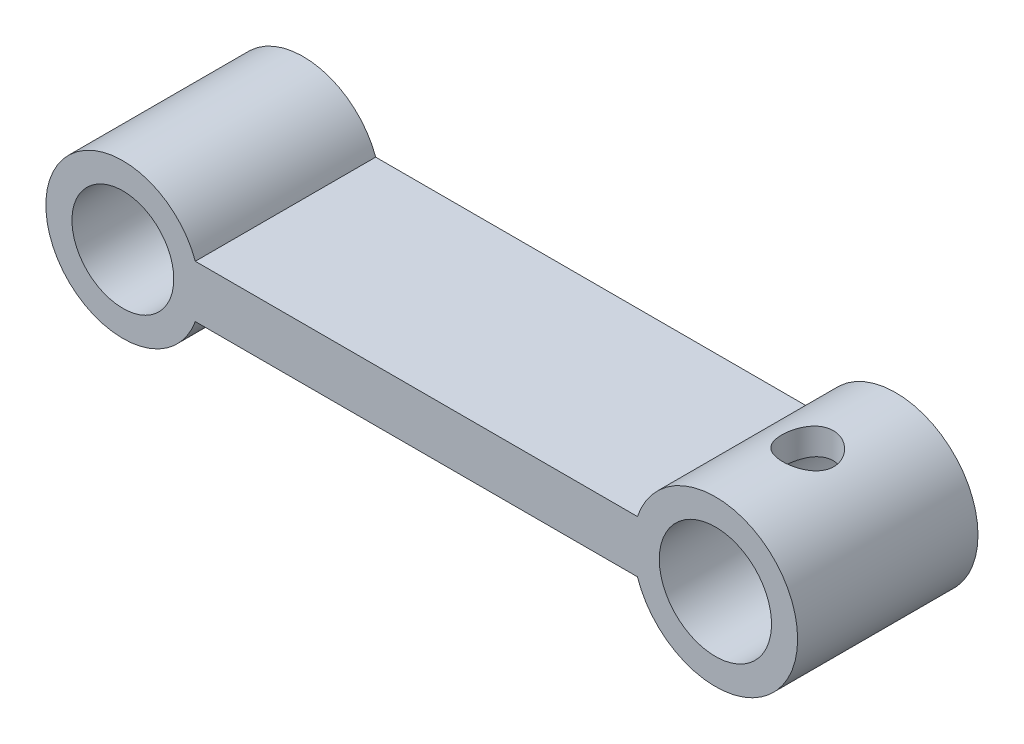
ISO-10303-21;
HEADER;
FILE_DESCRIPTION(('STEP AP214'),'2;1');
FILE_NAME('part.step','',(''),(''),'','','');
FILE_SCHEMA(('AUTOMOTIVE_DESIGN { 1 0 10303 214 1 1 1 1 }'));
ENDSEC;
DATA;
#1=APPLICATION_CONTEXT('core data for automotive mechanical design processes');
#2=APPLICATION_PROTOCOL_DEFINITION('international standard','automotive_design',2000,#1);
#3=PRODUCT_CONTEXT('',#1,'mechanical');
#4=PRODUCT('Part','Part','',(#3));
#5=PRODUCT_RELATED_PRODUCT_CATEGORY('part','',(#4));
#6=PRODUCT_DEFINITION_FORMATION('','',#4);
#7=PRODUCT_DEFINITION_CONTEXT('part definition',#1,'design');
#8=PRODUCT_DEFINITION('design','',#6,#7);
#9=PRODUCT_DEFINITION_SHAPE('','',#8);
#10=(LENGTH_UNIT() NAMED_UNIT(*) SI_UNIT(.MILLI.,.METRE.));
#11=(NAMED_UNIT(*) PLANE_ANGLE_UNIT() SI_UNIT($,.RADIAN.));
#12=(NAMED_UNIT(*) SI_UNIT($,.STERADIAN.) SOLID_ANGLE_UNIT());
#13=UNCERTAINTY_MEASURE_WITH_UNIT(LENGTH_MEASURE(1.E-05),#10,'distance_accuracy_value','');
#14=(GEOMETRIC_REPRESENTATION_CONTEXT(3) GLOBAL_UNCERTAINTY_ASSIGNED_CONTEXT((#13)) GLOBAL_UNIT_ASSIGNED_CONTEXT((#10,
#11,#12)) REPRESENTATION_CONTEXT('',''));
#15=CARTESIAN_POINT('',(0.,0.,0.));
#16=DIRECTION('',(0.,0.,1.));
#17=DIRECTION('',(1.,0.,0.));
#18=AXIS2_PLACEMENT_3D('',#15,#16,#17);
#19=CARTESIAN_POINT('',(-11.2441412055134,0.,6.91));
#20=DIRECTION('',(0.,0.,1.));
#21=DIRECTION('',(1.,0.,0.));
#22=AXIS2_PLACEMENT_3D('',#19,#20,#21);
#23=PLANE('',#22);
#24=CARTESIAN_POINT('',(-11.2441412055134,0.,6.91));
#25=DIRECTION('',(0.,0.,1.));
#26=DIRECTION('',(1.,0.,0.));
#27=AXIS2_PLACEMENT_3D('',#24,#25,#26);
#28=CIRCLE('',#27,1.95);
#29=CARTESIAN_POINT('',(-9.29414120551341,0.,6.91));
#30=VERTEX_POINT('',#29);
#31=EDGE_CURVE('E109',#30,#30,#28,.T.);
#32=ORIENTED_EDGE('',*,*,#31,.F.);
#33=EDGE_LOOP('',(#32));
#34=FACE_BOUND('',#33,.T.);
#35=CARTESIAN_POINT('',(-11.2441412055134,0.,6.91));
#36=DIRECTION('',(0.,0.,1.));
#37=DIRECTION('',(1.,0.,0.));
#38=AXIS2_PLACEMENT_3D('',#35,#36,#37);
#39=CIRCLE('',#38,2.95);
#40=CARTESIAN_POINT('',(-8.46880338823782,0.999999999999997,6.91));
#41=VERTEX_POINT('',#40);
#42=CARTESIAN_POINT('',(-8.46880338823782,-1.,6.91));
#43=VERTEX_POINT('',#42);
#44=EDGE_CURVE('E93',#41,#43,#39,.T.);
#45=ORIENTED_EDGE('',*,*,#44,.T.);
#46=DIRECTION('',(1.,0.,0.));
#47=VECTOR('',#46,1.);
#48=CARTESIAN_POINT('',(8.46880338823782,-1.,6.91));
#49=LINE('',#48,#47);
#50=CARTESIAN_POINT('',(8.46880338823782,-1.,6.91));
#51=VERTEX_POINT('',#50);
#52=EDGE_CURVE('E88',#43,#51,#49,.T.);
#53=ORIENTED_EDGE('',*,*,#52,.T.);
#54=CARTESIAN_POINT('',(11.4558587944866,0.,6.91));
#55=DIRECTION('',(0.,0.,1.));
#56=DIRECTION('',(1.,0.,0.));
#57=AXIS2_PLACEMENT_3D('',#54,#55,#56);
#58=CIRCLE('',#57,3.15);
#59=CARTESIAN_POINT('',(8.46880338823782,1.,6.91));
#60=VERTEX_POINT('',#59);
#61=EDGE_CURVE('E91',#51,#60,#58,.T.);
#62=ORIENTED_EDGE('',*,*,#61,.T.);
#63=DIRECTION('',(-1.,0.,0.));
#64=VECTOR('',#63,1.);
#65=CARTESIAN_POINT('',(8.46880338823782,1.,6.91));
#66=LINE('',#65,#64);
#67=EDGE_CURVE('E58',#60,#41,#66,.T.);
#68=ORIENTED_EDGE('',*,*,#67,.T.);
#69=EDGE_LOOP('',(#45,#53,#62,#68));
#70=FACE_BOUND('',#69,.T.);
#71=CARTESIAN_POINT('',(11.4558587944866,0.,6.91));
#72=DIRECTION('',(0.,0.,1.));
#73=DIRECTION('',(-1.,0.,0.));
#74=AXIS2_PLACEMENT_3D('',#71,#72,#73);
#75=CIRCLE('',#74,2.15);
#76=CARTESIAN_POINT('',(9.30585879448659,0.,6.91));
#77=VERTEX_POINT('',#76);
#78=EDGE_CURVE('E175',#77,#77,#75,.T.);
#79=ORIENTED_EDGE('',*,*,#78,.F.);
#80=EDGE_LOOP('',(#79));
#81=FACE_BOUND('',#80,.T.);
#82=ADVANCED_FACE('F35',(#34,#70,#81),#23,.T.);
#83=CARTESIAN_POINT('',(-11.2441412055134,0.,0.));
#84=DIRECTION('',(0.,0.,1.));
#85=DIRECTION('',(1.,0.,0.));
#86=AXIS2_PLACEMENT_3D('',#83,#84,#85);
#87=PLANE('',#86);
#88=CARTESIAN_POINT('',(-11.2441412055134,0.,0.));
#89=DIRECTION('',(0.,0.,1.));
#90=DIRECTION('',(1.,0.,0.));
#91=AXIS2_PLACEMENT_3D('',#88,#89,#90);
#92=CIRCLE('',#91,2.95);
#93=CARTESIAN_POINT('',(-8.46880338823782,0.999999999999997,0.));
#94=VERTEX_POINT('',#93);
#95=CARTESIAN_POINT('',(-8.46880338823782,-1.,0.));
#96=VERTEX_POINT('',#95);
#97=EDGE_CURVE('E106',#94,#96,#92,.T.);
#98=ORIENTED_EDGE('',*,*,#97,.F.);
#99=DIRECTION('',(-1.,0.,0.));
#100=VECTOR('',#99,1.);
#101=CARTESIAN_POINT('',(8.46880338823782,1.,0.));
#102=LINE('',#101,#100);
#103=CARTESIAN_POINT('',(8.46880338823782,1.,0.));
#104=VERTEX_POINT('',#103);
#105=EDGE_CURVE('E81',#104,#94,#102,.T.);
#106=ORIENTED_EDGE('',*,*,#105,.F.);
#107=CARTESIAN_POINT('',(11.4558587944866,0.,0.));
#108=DIRECTION('',(0.,0.,1.));
#109=DIRECTION('',(1.,0.,0.));
#110=AXIS2_PLACEMENT_3D('',#107,#108,#109);
#111=CIRCLE('',#110,3.15);
#112=CARTESIAN_POINT('',(8.46880338823782,-1.,0.));
#113=VERTEX_POINT('',#112);
#114=EDGE_CURVE('E75',#113,#104,#111,.T.);
#115=ORIENTED_EDGE('',*,*,#114,.F.);
#116=DIRECTION('',(1.,0.,0.));
#117=VECTOR('',#116,1.);
#118=CARTESIAN_POINT('',(8.46880338823782,-1.,0.));
#119=LINE('',#118,#117);
#120=EDGE_CURVE('E97',#96,#113,#119,.T.);
#121=ORIENTED_EDGE('',*,*,#120,.F.);
#122=EDGE_LOOP('',(#98,#106,#115,#121));
#123=FACE_BOUND('',#122,.T.);
#124=CARTESIAN_POINT('',(-11.2441412055134,0.,0.));
#125=DIRECTION('',(0.,0.,1.));
#126=DIRECTION('',(1.,0.,0.));
#127=AXIS2_PLACEMENT_3D('',#124,#125,#126);
#128=CIRCLE('',#127,1.95);
#129=CARTESIAN_POINT('',(-9.29414120551341,0.,0.));
#130=VERTEX_POINT('',#129);
#131=EDGE_CURVE('E173',#130,#130,#128,.T.);
#132=ORIENTED_EDGE('',*,*,#131,.T.);
#133=EDGE_LOOP('',(#132));
#134=FACE_BOUND('',#133,.T.);
#135=CARTESIAN_POINT('',(11.4558587944866,0.,0.));
#136=DIRECTION('',(0.,0.,1.));
#137=DIRECTION('',(-1.,0.,0.));
#138=AXIS2_PLACEMENT_3D('',#135,#136,#137);
#139=CIRCLE('',#138,2.15);
#140=CARTESIAN_POINT('',(9.30585879448659,0.,0.));
#141=VERTEX_POINT('',#140);
#142=EDGE_CURVE('E179',#141,#141,#139,.T.);
#143=ORIENTED_EDGE('',*,*,#142,.T.);
#144=EDGE_LOOP('',(#143));
#145=FACE_BOUND('',#144,.T.);
#146=ADVANCED_FACE('F151',(#123,#134,#145),#87,.F.);
#147=CARTESIAN_POINT('',(-11.2441412055134,0.,6.91));
#148=DIRECTION('',(0.,0.,-1.));
#149=DIRECTION('',(-1.,0.,0.));
#150=AXIS2_PLACEMENT_3D('',#147,#148,#149);
#151=CYLINDRICAL_SURFACE('',#150,2.95);
#152=ORIENTED_EDGE('',*,*,#97,.T.);
#153=DIRECTION('',(0.,0.,-1.));
#154=VECTOR('',#153,1.);
#155=CARTESIAN_POINT('',(-8.46880338823782,-1.,6.91));
#156=LINE('',#155,#154);
#157=EDGE_CURVE('E11',#43,#96,#156,.T.);
#158=ORIENTED_EDGE('',*,*,#157,.F.);
#159=ORIENTED_EDGE('',*,*,#44,.F.);
#160=DIRECTION('',(0.,0.,-1.));
#161=VECTOR('',#160,1.);
#162=CARTESIAN_POINT('',(-8.46880338823782,0.999999999999997,6.91));
#163=LINE('',#162,#161);
#164=EDGE_CURVE('E102',#41,#94,#163,.T.);
#165=ORIENTED_EDGE('',*,*,#164,.T.);
#166=EDGE_LOOP('',(#152,#158,#159,#165));
#167=FACE_BOUND('',#166,.T.);
#168=ADVANCED_FACE('F37',(#167),#151,.T.);
#169=CARTESIAN_POINT('',(8.46880338823782,-1.,6.91));
#170=DIRECTION('',(0.,1.,0.));
#171=DIRECTION('',(-1.,0.,0.));
#172=AXIS2_PLACEMENT_3D('',#169,#170,#171);
#173=PLANE('',#172);
#174=ORIENTED_EDGE('',*,*,#120,.T.);
#175=DIRECTION('',(0.,0.,-1.));
#176=VECTOR('',#175,1.);
#177=CARTESIAN_POINT('',(8.46880338823782,-1.,6.91));
#178=LINE('',#177,#176);
#179=EDGE_CURVE('E49',#51,#113,#178,.T.);
#180=ORIENTED_EDGE('',*,*,#179,.F.);
#181=ORIENTED_EDGE('',*,*,#52,.F.);
#182=ORIENTED_EDGE('',*,*,#157,.T.);
#183=EDGE_LOOP('',(#174,#180,#181,#182));
#184=FACE_BOUND('',#183,.T.);
#185=ADVANCED_FACE('F96',(#184),#173,.F.);
#186=CARTESIAN_POINT('',(11.4558587944866,0.,6.91));
#187=DIRECTION('',(0.,0.,-1.));
#188=DIRECTION('',(-1.,0.,0.));
#189=AXIS2_PLACEMENT_3D('',#186,#187,#188);
#190=CYLINDRICAL_SURFACE('',#189,3.15);
#191=CARTESIAN_POINT('',(11.5373310913622,-3.14894621498079,4.455));
#192=CARTESIAN_POINT('',(11.5923109036537,-3.14752337164463,4.4549995696927));
#193=CARTESIAN_POINT('',(11.6472572566072,-3.14464751501921,4.45045066525721));
#194=CARTESIAN_POINT('',(11.7554629843393,-3.13618972200122,4.43246035947395));
#195=CARTESIAN_POINT('',(11.808721887175,-3.13060703556187,4.41901649300732));
#196=CARTESIAN_POINT('',(11.9119813500246,-3.11723596990927,4.38376742559639));
#197=CARTESIAN_POINT('',(11.961987584584,-3.10945156603101,4.36197726949434));
#198=CARTESIAN_POINT('',(12.0576091413254,-3.09237105470762,4.31071916200779));
#199=CARTESIAN_POINT('',(12.1032237467134,-3.08307470114837,4.28124996016239));
#200=CARTESIAN_POINT('',(12.1903839532292,-3.06350010176719,4.21436500225506));
#201=CARTESIAN_POINT('',(12.2317527948112,-3.05319996361003,4.17672526993276));
#202=CARTESIAN_POINT('',(12.3076945823939,-3.03289038552376,4.09503988395326));
#203=CARTESIAN_POINT('',(12.3422661436813,-3.02288100517983,4.0509929282167));
#204=CARTESIAN_POINT('',(12.4044058346278,-3.00397083381094,3.9564517737423));
#205=CARTESIAN_POINT('',(12.4317922953301,-2.99510125580104,3.90583140957379));
#206=CARTESIAN_POINT('',(12.4775695801043,-2.97979768118698,3.80033254315995));
#207=CARTESIAN_POINT('',(12.4959635896383,-2.97336282229726,3.74545555676234));
#208=CARTESIAN_POINT('',(12.5225073657267,-2.96394215733998,3.635302028451));
#209=CARTESIAN_POINT('',(12.5310339312993,-2.96082986912,3.58012734957227));
#210=CARTESIAN_POINT('',(12.5387798273134,-2.95800624293732,3.46904948242248));
#211=CARTESIAN_POINT('',(12.5380020702647,-2.95829384071612,3.41314652759509));
#212=CARTESIAN_POINT('',(12.527437000652,-2.962135549883,3.30498373646894));
#213=CARTESIAN_POINT('',(12.5180743387938,-2.96553568710934,3.25267607175721));
#214=CARTESIAN_POINT('',(12.491284944595,-2.97499453569809,3.15042440278082));
#215=CARTESIAN_POINT('',(12.4738572325894,-2.98105357003318,3.10048068647856));
#216=CARTESIAN_POINT('',(12.4311238021242,-2.99530827425837,3.00333458176537));
#217=CARTESIAN_POINT('',(12.4056823323855,-3.00354033296088,2.95619746487024));
#218=CARTESIAN_POINT('',(12.3477517405263,-3.02124849254084,2.86673080714706));
#219=CARTESIAN_POINT('',(12.3152605385599,-3.03072496022339,2.82440269072038));
#220=CARTESIAN_POINT('',(12.2420428716133,-3.05056200443685,2.7432919955278));
#221=CARTESIAN_POINT('',(12.2009601990726,-3.06094248668271,2.70483520928965));
#222=CARTESIAN_POINT('',(12.1128319868486,-3.08105937134593,2.63527408264434));
#223=CARTESIAN_POINT('',(12.0657856737235,-3.09079568997015,2.60417069742259));
#224=CARTESIAN_POINT('',(11.9661636883677,-3.10880762061306,2.54981054046114));
#225=CARTESIAN_POINT('',(11.9135171133878,-3.1170597458192,2.52667538619897));
#226=CARTESIAN_POINT('',(11.8047441897859,-3.13109896223819,2.48970897861257));
#227=CARTESIAN_POINT('',(11.7486189568058,-3.13688683912286,2.47587475907234));
#228=CARTESIAN_POINT('',(11.6369106122755,-3.14527103129834,2.45843121241839));
#229=CARTESIAN_POINT('',(11.5813976051757,-3.14798711191793,2.45443046656887));
#230=CARTESIAN_POINT('',(11.4704166739643,-3.15045499054788,2.45570004423203));
#231=CARTESIAN_POINT('',(11.4149487432328,-3.15020735891431,2.46096858373663));
#232=CARTESIAN_POINT('',(11.3075018775119,-3.14694920916444,2.48028814127817));
#233=CARTESIAN_POINT('',(11.2554681007458,-3.1440276454887,2.49405177813293));
#234=CARTESIAN_POINT('',(11.15443040208,-3.13595464792687,2.52965841114161));
#235=CARTESIAN_POINT('',(11.1054267717298,-3.13080299985065,2.55150218332889));
#236=CARTESIAN_POINT('',(11.0108090719919,-3.11877375869819,2.6031004345495));
#237=CARTESIAN_POINT('',(10.9652755405067,-3.11186568692956,2.63299522838817));
#238=CARTESIAN_POINT('',(10.8797310670489,-3.09717028365439,2.69968198688633));
#239=CARTESIAN_POINT('',(10.8397215337977,-3.08938272878055,2.73647570527842));
#240=CARTESIAN_POINT('',(10.7647317968425,-3.07349504933865,2.81761486299661));
#241=CARTESIAN_POINT('',(10.730010383843,-3.06539464457452,2.86219988292552));
#242=CARTESIAN_POINT('',(10.668496712291,-3.05017515758148,2.95669786444614));
#243=CARTESIAN_POINT('',(10.6417045789635,-3.04305609085152,3.00661091016499));
#244=CARTESIAN_POINT('',(10.5968325497672,-3.03069622193775,3.1105178592419));
#245=CARTESIAN_POINT('',(10.5787638766685,-3.02545784147324,3.16451691656932));
#246=CARTESIAN_POINT('',(10.5520311162249,-3.01758069241215,3.27497235048387));
#247=CARTESIAN_POINT('',(10.5433639535983,-3.0149410737735,3.33142791724553));
#248=CARTESIAN_POINT('',(10.5359084850506,-3.01267411394926,3.44283482390005));
#249=CARTESIAN_POINT('',(10.5367490349408,-3.01293359803708,3.49775925790597));
#250=CARTESIAN_POINT('',(10.547384214118,-3.01615717064057,3.60664898335142));
#251=CARTESIAN_POINT('',(10.5571784589274,-3.01912114302368,3.66061431587396));
#252=CARTESIAN_POINT('',(10.5851818867876,-3.02731376260367,3.76534121518758));
#253=CARTESIAN_POINT('',(10.6032764224898,-3.03251149622844,3.81613604844237));
#254=CARTESIAN_POINT('',(10.6472804789486,-3.04453920056519,3.91401023320033));
#255=CARTESIAN_POINT('',(10.673191502649,-3.05136948512934,3.96108886795956));
#256=CARTESIAN_POINT('',(10.7331497096681,-3.0661335086204,4.05195626202873));
#257=CARTESIAN_POINT('',(10.7674472661906,-3.07409723836103,4.09557495305698));
#258=CARTESIAN_POINT('',(10.8427783625453,-3.09000193964675,4.17656512040043));
#259=CARTESIAN_POINT('',(10.8838134446747,-3.09794290555647,4.21393516236532));
#260=CARTESIAN_POINT('',(10.972759556159,-3.11306917650697,4.28233744581932));
#261=CARTESIAN_POINT('',(11.0208221283621,-3.12022934089516,4.31317875409965));
#262=CARTESIAN_POINT('',(11.1216814281035,-3.13263478517831,4.36630713109639));
#263=CARTESIAN_POINT('',(11.1744761399185,-3.13788087561747,4.38859782091025));
#264=CARTESIAN_POINT('',(11.2785051150874,-3.14539720741227,4.42233290824422));
#265=CARTESIAN_POINT('',(11.3294719764906,-3.14788759825205,4.43455545046022));
#266=CARTESIAN_POINT('',(11.4327464879135,-3.1503383434259,4.45088853082696));
#267=CARTESIAN_POINT('',(11.4850539149758,-3.15029911578117,4.45500040915474));
#268=CARTESIAN_POINT('',(11.5373310913622,-3.14894621498079,4.455));
#269=B_SPLINE_CURVE_WITH_KNOTS('',3,(#191,#192,#193,#194,#195,#196,#197,#198,#199,#200,#201,
#202,#203,#204,#205,#206,#207,#208,#209,#210,#211,#212,#213,#214,#215,#216,#217,#218,#219,#220,
#221,#222,#223,#224,#225,#226,#227,#228,#229,#230,#231,#232,#233,#234,#235,#236,#237,#238,#239,
#240,#241,#242,#243,#244,#245,#246,#247,#248,#249,#250,#251,#252,#253,#254,#255,#256,#257,#258,
#259,#260,#261,#262,#263,#264,#265,#266,#267,#268),.UNSPECIFIED.,.T.,.F.,(4,2,2,2,2,2,2,2,2,2,2,
2,2,2,2,2,2,2,2,2,2,2,2,2,2,2,2,2,2,2,2,2,2,2,2,2,2,2,4),(0.,0.164800459961615,
0.329646611291067,0.494197002358483,0.658774205683726,0.828614159284596,0.998488676195921,
1.1723157558979,1.34608121485964,1.51296612034669,1.67979878761945,1.83879980620313,
1.99782014377615,2.15969393856647,2.32161555523358,2.49249696895632,2.66340056749684,
2.83680769112384,3.01015948619506,3.17649049222589,3.34278948894976,3.50374965217405,
3.66472527836995,3.82871167379731,3.99273981183834,4.16320108122736,4.33366504252151,
4.50434772591064,4.67497456127572,4.83896453363715,5.00294746449061,5.16473059535624,
5.32654485351058,5.49395486793485,5.66140325800443,5.83322325851811,6.00497041451616,
6.16169569732811,6.31839508124552),.UNSPECIFIED.);
#270=CARTESIAN_POINT('',(11.5373310913622,-3.14894621498079,4.455));
#271=VERTEX_POINT('',#270);
#272=EDGE_CURVE('E136',#271,#271,#269,.T.);
#273=ORIENTED_EDGE('',*,*,#272,.T.);
#274=EDGE_LOOP('',(#273));
#275=FACE_BOUND('',#274,.T.);
#276=CARTESIAN_POINT('',(11.5373310913622,3.14894621498078,4.455));
#277=CARTESIAN_POINT('',(11.4828718288174,3.15035523022879,4.45499999085899));
#278=CARTESIAN_POINT('',(11.428374744667,3.15033845124775,4.45053697026065));
#279=CARTESIAN_POINT('',(11.3209005226152,3.14756695395263,4.43281635730675));
#280=CARTESIAN_POINT('',(11.2679235658665,3.14481191070409,4.4195577212869));
#281=CARTESIAN_POINT('',(11.1650586347242,3.13697226464123,4.38470910351581));
#282=CARTESIAN_POINT('',(11.1151665990352,3.13189080201227,4.36313035836909));
#283=CARTESIAN_POINT('',(11.0196810579971,3.12002675265368,4.3123012199703));
#284=CARTESIAN_POINT('',(10.9740882907792,3.11324387454106,4.28304951261386));
#285=CARTESIAN_POINT('',(10.8872187968174,3.09857060191957,4.21684710771031));
#286=CARTESIAN_POINT('',(10.8460798800354,3.09065659468926,4.17972088456186));
#287=CARTESIAN_POINT('',(10.7704809856074,3.07477680964543,4.09919859789526));
#288=CARTESIAN_POINT('',(10.7360222367039,3.06681102258554,4.05580138345543));
#289=CARTESIAN_POINT('',(10.6738319896969,3.05155537347412,3.96253823183664));
#290=CARTESIAN_POINT('',(10.6463108392478,3.04429003162581,3.91252756100021));
#291=CARTESIAN_POINT('',(10.6001095167692,3.03162842807018,3.80835579916051));
#292=CARTESIAN_POINT('',(10.581427534391,3.026231783696,3.7541955606721));
#293=CARTESIAN_POINT('',(10.5538784641958,3.01813434311036,3.64457777217019));
#294=CARTESIAN_POINT('',(10.5447936685899,3.0153738921628,3.58917949553196));
#295=CARTESIAN_POINT('',(10.536021487645,3.01271007421088,3.47758158287649));
#296=CARTESIAN_POINT('',(10.5363318549036,3.01280602393121,3.42138214171957));
#297=CARTESIAN_POINT('',(10.5461535818059,3.0157850182159,3.31188189631693));
#298=CARTESIAN_POINT('',(10.5553399152396,3.01856960589566,3.25854878173385));
#299=CARTESIAN_POINT('',(10.582118793965,3.02642877575449,3.15421616082513));
#300=CARTESIAN_POINT('',(10.599712169735,3.03150358416714,3.10321688559014));
#301=CARTESIAN_POINT('',(10.6430241674282,3.04340395317468,3.00425700304667));
#302=CARTESIAN_POINT('',(10.6688410835213,3.05025049483782,2.95634205477016));
#303=CARTESIAN_POINT('',(10.7278099148974,3.06485974338142,2.8654123543758));
#304=CARTESIAN_POINT('',(10.7609635758115,3.0726226680914,2.82239877213563));
#305=CARTESIAN_POINT('',(10.8352234426421,3.08849583717522,2.74071010550864));
#306=CARTESIAN_POINT('',(10.8765919088974,3.09660769540724,2.70227330478389));
#307=CARTESIAN_POINT('',(10.9653131674531,3.11189463510046,2.63282672484441));
#308=CARTESIAN_POINT('',(11.0126661474923,3.11906968715898,2.60181717871667));
#309=CARTESIAN_POINT('',(11.1122488778077,3.13160561434851,2.5480747700758));
#310=CARTESIAN_POINT('',(11.1644907750412,3.13696180904355,2.52536324951455));
#311=CARTESIAN_POINT('',(11.2722490411523,3.14510760471761,2.48910119142605));
#312=CARTESIAN_POINT('',(11.327764406034,3.14789798833692,2.47554786074318));
#313=CARTESIAN_POINT('',(11.4381854849414,3.15041578749106,2.45842038710991));
#314=CARTESIAN_POINT('',(11.493032212132,3.15025712383688,2.45448171889526));
#315=CARTESIAN_POINT('',(11.6025416657704,3.14705951622872,2.45562760880372));
#316=CARTESIAN_POINT('',(11.6572044120974,3.14402089418155,2.46071115852555));
#317=CARTESIAN_POINT('',(11.7637045708037,3.13536801730975,2.4794882874541));
#318=CARTESIAN_POINT('',(11.8155762350735,3.12980492424408,2.49301275252061));
#319=CARTESIAN_POINT('',(11.9162642166613,3.11658591295433,2.52804131835569));
#320=CARTESIAN_POINT('',(11.9650800671905,3.10892967594757,2.54954663477438));
#321=CARTESIAN_POINT('',(12.0599379771851,3.0919222291668,2.60067313884115));
#322=CARTESIAN_POINT('',(12.1058476426499,3.08252593937604,2.63052466013094));
#323=CARTESIAN_POINT('',(12.1921186848956,3.06306715136289,2.69722157693725));
#324=CARTESIAN_POINT('',(12.2324783562478,3.05300444976338,2.73406911397908));
#325=CARTESIAN_POINT('',(12.3082849507926,3.03273403242309,2.81558064506303));
#326=CARTESIAN_POINT('',(12.3434502792226,3.02253832110513,2.86051022836824));
#327=CARTESIAN_POINT('',(12.405748210083,3.00354365151769,2.95590476898346));
#328=CARTESIAN_POINT('',(12.4328811590619,2.99474463299696,3.00636948735708));
#329=CARTESIAN_POINT('',(12.4780271766216,2.97963703705348,3.11103959978058));
#330=CARTESIAN_POINT('',(12.4961201738153,2.97330674555909,3.16520721454351));
#331=CARTESIAN_POINT('',(12.5228455053805,2.96382265189445,3.27608827638616));
#332=CARTESIAN_POINT('',(12.5314823389963,2.96066733912669,3.33280049935787));
#333=CARTESIAN_POINT('',(12.5387279843382,2.95802418141831,3.44379256339467));
#334=CARTESIAN_POINT('',(12.5378638708317,2.95834356340745,3.49803393301897));
#335=CARTESIAN_POINT('',(12.5274075389809,2.96214678462158,3.60555042867191));
#336=CARTESIAN_POINT('',(12.5178157942035,2.96563045215039,3.65882560696674));
#337=CARTESIAN_POINT('',(12.4905217897553,2.97526045640643,3.76195840368364));
#338=CARTESIAN_POINT('',(12.4729676199915,2.98135806843528,3.81186009763714));
#339=CARTESIAN_POINT('',(12.4303688272095,2.99555202995674,3.90804757311149));
#340=CARTESIAN_POINT('',(12.4053225326604,3.00364882540683,3.95433254481396));
#341=CARTESIAN_POINT('',(12.3471059205987,3.02144745341333,4.04429329382459));
#342=CARTESIAN_POINT('',(12.3136131775881,3.03120623844435,4.08774907482188));
#343=CARTESIAN_POINT('',(12.2400309684841,3.05106941955864,4.16858385316348));
#344=CARTESIAN_POINT('',(12.1999394393772,3.06117392294062,4.20596094280579));
#345=CARTESIAN_POINT('',(12.1122548131751,3.08119275305514,4.27519142219896));
#346=CARTESIAN_POINT('',(12.0644140953518,3.09108043171973,4.30673993971033));
#347=CARTESIAN_POINT('',(11.9638075171777,3.10919526934051,4.36130568403419));
#348=CARTESIAN_POINT('',(11.9110430940831,3.11742291066681,4.38432539076105));
#349=CARTESIAN_POINT('',(11.8054337496456,3.13096681263616,4.41989915440839));
#350=CARTESIAN_POINT('',(11.7527967054298,3.13643196889923,4.43301366256933));
#351=CARTESIAN_POINT('',(11.6458957029797,3.14471884341986,4.45056289127098));
#352=CARTESIAN_POINT('',(11.5916321982953,3.14754129166605,4.45500000911446));
#353=CARTESIAN_POINT('',(11.5373310913622,3.14894621498078,4.455));
#354=B_SPLINE_CURVE_WITH_KNOTS('',3,(#276,#277,#278,#279,#280,#281,#282,#283,#284,#285,#286,
#287,#288,#289,#290,#291,#292,#293,#294,#295,#296,#297,#298,#299,#300,#301,#302,#303,#304,#305,
#306,#307,#308,#309,#310,#311,#312,#313,#314,#315,#316,#317,#318,#319,#320,#321,#322,#323,#324,
#325,#326,#327,#328,#329,#330,#331,#332,#333,#334,#335,#336,#337,#338,#339,#340,#341,#342,#343,
#344,#345,#346,#347,#348,#349,#350,#351,#352,#353),.UNSPECIFIED.,.T.,.F.,(4,2,2,2,2,2,2,2,2,2,2,
2,2,2,2,2,2,2,2,2,2,2,2,2,2,2,2,2,2,2,2,2,2,2,2,2,2,2,4),(0.,0.163234864569554,
0.326489101618495,0.489523625930927,0.652586090485524,0.819760009733437,0.986964649649061,
1.15875362178654,1.33050739460581,1.49827537379018,1.66600322177102,1.82781310585757,
1.98963897741988,2.1534766734218,2.3173533933094,2.48769902896311,2.65805000981543,
2.82883608785955,2.9995700543323,3.1637228146839,3.32785722905546,3.48880433617903,
3.64977596897328,3.81572368195338,3.98172227473144,4.15477388383944,4.32781802572833,
4.49930381887906,4.67070798355387,4.83265357098702,4.99459037167259,5.15363159919842,
5.31270833612325,5.47914963335169,5.64564306519141,5.81926220665478,5.99283082534889,
6.15563662286536,6.31839743566386),.UNSPECIFIED.);
#355=CARTESIAN_POINT('',(11.5373310913622,3.14894621498078,4.455));
#356=VERTEX_POINT('',#355);
#357=EDGE_CURVE('E131',#356,#356,#354,.T.);
#358=ORIENTED_EDGE('',*,*,#357,.T.);
#359=EDGE_LOOP('',(#358));
#360=FACE_BOUND('',#359,.T.);
#361=ORIENTED_EDGE('',*,*,#114,.T.);
#362=DIRECTION('',(0.,0.,-1.));
#363=VECTOR('',#362,1.);
#364=CARTESIAN_POINT('',(8.46880338823782,1.,6.91));
#365=LINE('',#364,#363);
#366=EDGE_CURVE('E98',#60,#104,#365,.T.);
#367=ORIENTED_EDGE('',*,*,#366,.F.);
#368=ORIENTED_EDGE('',*,*,#61,.F.);
#369=ORIENTED_EDGE('',*,*,#179,.T.);
#370=EDGE_LOOP('',(#361,#367,#368,#369));
#371=FACE_BOUND('',#370,.T.);
#372=ADVANCED_FACE('F100',(#275,#360,#371),#190,.T.);
#373=CARTESIAN_POINT('',(8.46880338823782,1.,6.91));
#374=DIRECTION('',(0.,-1.,0.));
#375=DIRECTION('',(1.,0.,0.));
#376=AXIS2_PLACEMENT_3D('',#373,#374,#375);
#377=PLANE('',#376);
#378=ORIENTED_EDGE('',*,*,#105,.T.);
#379=ORIENTED_EDGE('',*,*,#164,.F.);
#380=ORIENTED_EDGE('',*,*,#67,.F.);
#381=ORIENTED_EDGE('',*,*,#366,.T.);
#382=EDGE_LOOP('',(#378,#379,#380,#381));
#383=FACE_BOUND('',#382,.T.);
#384=ADVANCED_FACE('F143',(#383),#377,.F.);
#385=CARTESIAN_POINT('',(-11.2441412055134,0.,6.91));
#386=DIRECTION('',(0.,0.,-1.));
#387=DIRECTION('',(-1.,0.,0.));
#388=AXIS2_PLACEMENT_3D('',#385,#386,#387);
#389=CYLINDRICAL_SURFACE('',#388,1.95);
#390=ORIENTED_EDGE('',*,*,#31,.T.);
#391=EDGE_LOOP('',(#390));
#392=FACE_BOUND('',#391,.T.);
#393=ORIENTED_EDGE('',*,*,#131,.F.);
#394=EDGE_LOOP('',(#393));
#395=FACE_BOUND('',#394,.T.);
#396=ADVANCED_FACE('F161',(#392,#395),#389,.F.);
#397=CARTESIAN_POINT('',(11.4558587944866,0.,6.91));
#398=DIRECTION('',(0.,0.,-1.));
#399=DIRECTION('',(-1.,0.,0.));
#400=AXIS2_PLACEMENT_3D('',#397,#398,#399);
#401=CYLINDRICAL_SURFACE('',#400,2.15);
#402=CARTESIAN_POINT('',(11.5373310913622,-2.14845578610355,4.455));
#403=CARTESIAN_POINT('',(11.5908587633814,-2.14642093747831,4.45499363941445));
#404=CARTESIAN_POINT('',(11.6443684211082,-2.14237122899894,4.45067745262961));
#405=CARTESIAN_POINT('',(11.7496871510399,-2.13049082610558,4.43365481894034));
#406=CARTESIAN_POINT('',(11.8014918099625,-2.12265103519781,4.42092815913615));
#407=CARTESIAN_POINT('',(11.901704764421,-2.10387958232259,4.38774099865022));
#408=CARTESIAN_POINT('',(11.9501262046514,-2.09296082493071,4.36731265934881));
#409=CARTESIAN_POINT('',(12.0427326707185,-2.06890576564961,4.31945824105188));
#410=CARTESIAN_POINT('',(12.0869185957909,-2.0557699361058,4.29203365196645));
#411=CARTESIAN_POINT('',(12.172894676079,-2.02744516052614,4.22899934777295));
#412=CARTESIAN_POINT('',(12.2143629881793,-2.01217923223921,4.19298548641392));
#413=CARTESIAN_POINT('',(12.2908972702476,-1.98164371906005,4.11465150144956));
#414=CARTESIAN_POINT('',(12.3259583249435,-1.96637414028385,4.07232658119252));
#415=CARTESIAN_POINT('',(12.3908729352525,-1.93639020264715,3.97929181985087));
#416=CARTESIAN_POINT('',(12.4202582273397,-1.92177169393915,3.92822138919207));
#417=CARTESIAN_POINT('',(12.4698251530973,-1.89609011379229,3.82097220495494));
#418=CARTESIAN_POINT('',(12.4900151995129,-1.88502379519688,3.76479817734585));
#419=CARTESIAN_POINT('',(12.5190272179869,-1.86880487005922,3.65332926605266));
#420=CARTESIAN_POINT('',(12.5285883192333,-1.86327093591133,3.59828450930795));
#421=CARTESIAN_POINT('',(12.538367800304,-1.8576089154229,3.48711469410939));
#422=CARTESIAN_POINT('',(12.5385943863983,-1.85747608080496,3.4309906279479));
#423=CARTESIAN_POINT('',(12.5302361438793,-1.8623177104864,3.32625730622794));
#424=CARTESIAN_POINT('',(12.5226735114114,-1.86669970666528,3.27753350712463));
#425=CARTESIAN_POINT('',(12.500636456189,-1.87912164918419,3.18216458187731));
#426=CARTESIAN_POINT('',(12.4861599604365,-1.8871626925898,3.13552008376354));
#427=CARTESIAN_POINT('',(12.450301752576,-1.90630688474024,3.04392884126179));
#428=CARTESIAN_POINT('',(12.4287202369024,-1.91749708356082,2.99907928828334));
#429=CARTESIAN_POINT('',(12.3794367366787,-1.94171496812478,2.91342594364143));
#430=CARTESIAN_POINT('',(12.3517319667959,-1.9547434891018,2.87262400542497));
#431=CARTESIAN_POINT('',(12.2868845269716,-1.98325570336349,2.79074613972311));
#432=CARTESIAN_POINT('',(12.2489885540802,-1.99884050917819,2.75030004702507));
#433=CARTESIAN_POINT('',(12.1669157869106,-2.02948696222475,2.67609977968588));
#434=CARTESIAN_POINT('',(12.1227359496473,-2.04454835156729,2.64234886628458));
#435=CARTESIAN_POINT('',(12.0265582351216,-2.07351064842028,2.58088685378738));
#436=CARTESIAN_POINT('',(11.9742776148473,-2.08731405890728,2.55356853758758));
#437=CARTESIAN_POINT('',(11.8650390684115,-2.11144289196637,2.50837748499321));
#438=CARTESIAN_POINT('',(11.8080844218841,-2.12177072773322,2.49049818987962));
#439=CARTESIAN_POINT('',(11.6956718077094,-2.1372795923248,2.46606934918565));
#440=CARTESIAN_POINT('',(11.6404227034649,-2.14278891722817,2.45876973079716));
#441=CARTESIAN_POINT('',(11.5292291226358,-2.14946805720359,2.45348729985667));
#442=CARTESIAN_POINT('',(11.4732850003787,-2.1506399992197,2.45549991972616));
#443=CARTESIAN_POINT('',(11.3668866957037,-2.14876674868718,2.46828958741838));
#444=CARTESIAN_POINT('',(11.3163419615172,-2.14603994642706,2.47837844901419));
#445=CARTESIAN_POINT('',(11.2176618722134,-2.13733866391556,2.50608563863358));
#446=CARTESIAN_POINT('',(11.16952669763,-2.13136394071353,2.52370452989658));
#447=CARTESIAN_POINT('',(11.0759919370374,-2.11671559773204,2.56626198668801));
#448=CARTESIAN_POINT('',(11.0306578266426,-2.1079949789776,2.59132755236585));
#449=CARTESIAN_POINT('',(10.9446366090336,-2.08880280986101,2.64792693779963));
#450=CARTESIAN_POINT('',(10.9039513352591,-2.07833057266792,2.67946329593623));
#451=CARTESIAN_POINT('',(10.8249291325251,-2.05578438701353,2.75104743336128));
#452=CARTESIAN_POINT('',(10.7870441737983,-2.04364935673286,2.79157573952647));
#453=CARTESIAN_POINT('',(10.7184033704931,-2.01989645524279,2.87843820422058));
#454=CARTESIAN_POINT('',(10.6876505121071,-2.00827880229695,2.92477478219479));
#455=CARTESIAN_POINT('',(10.6331355029584,-1.98658515031742,3.0240165093398));
#456=CARTESIAN_POINT('',(10.6096627931264,-1.97657917005047,3.07709734145968));
#457=CARTESIAN_POINT('',(10.5721667558622,-1.96010564816398,3.18700434538608));
#458=CARTESIAN_POINT('',(10.5581354826056,-1.95363513199545,3.2438273235041));
#459=CARTESIAN_POINT('',(10.54084366244,-1.94559296778364,3.35521575769949));
#460=CARTESIAN_POINT('',(10.5368797287247,-1.94370185757458,3.40964875632965));
#461=CARTESIAN_POINT('',(10.5378639694081,-1.94416734340656,3.51840826279908));
#462=CARTESIAN_POINT('',(10.5428099054689,-1.94652287260684,3.57273479395286));
#463=CARTESIAN_POINT('',(10.5607929104952,-1.95485149774904,3.67628643512503));
#464=CARTESIAN_POINT('',(10.5733191261398,-1.9605956555499,3.72562077674369));
#465=CARTESIAN_POINT('',(10.6055309036101,-1.97477853529859,3.82147912245339));
#466=CARTESIAN_POINT('',(10.6252185129406,-1.98321802778183,3.86800231837294));
#467=CARTESIAN_POINT('',(10.6724732774666,-2.00237131709039,3.95981267654461));
#468=CARTESIAN_POINT('',(10.7004230665342,-2.01318673822811,4.00488115915088));
#469=CARTESIAN_POINT('',(10.7629693377867,-2.03556049501055,4.08994359702247));
#470=CARTESIAN_POINT('',(10.7975685017244,-2.04711912914394,4.12993549401222));
#471=CARTESIAN_POINT('',(10.8757341668493,-2.07068829600673,4.20702253039931));
#472=CARTESIAN_POINT('',(10.9197972075396,-2.08266076548307,4.24362838653763));
#473=CARTESIAN_POINT('',(11.013892217935,-2.10463680099787,4.30898573911605));
#474=CARTESIAN_POINT('',(11.0639262591184,-2.11463968053215,4.33773449830063));
#475=CARTESIAN_POINT('',(11.1677179651571,-2.13124080719344,4.38591424646451));
#476=CARTESIAN_POINT('',(11.2213927064136,-2.13789692435746,4.40550317164426));
#477=CARTESIAN_POINT('',(11.3315263422568,-2.1471075947197,4.4352438833794));
#478=CARTESIAN_POINT('',(11.3879766790185,-2.14967402896173,4.44542297038935));
#479=CARTESIAN_POINT('',(11.4755824991587,-2.15013273428693,4.45357378661818));
#480=CARTESIAN_POINT('',(11.5064597912503,-2.14962935521691,4.45500366837447));
#481=CARTESIAN_POINT('',(11.5373310913622,-2.14845578610355,4.455));
#482=B_SPLINE_CURVE_WITH_KNOTS('',3,(#402,#403,#404,#405,#406,#407,#408,#409,#410,#411,#412,
#413,#414,#415,#416,#417,#418,#419,#420,#421,#422,#423,#424,#425,#426,#427,#428,#429,#430,#431,
#432,#433,#434,#435,#436,#437,#438,#439,#440,#441,#442,#443,#444,#445,#446,#447,#448,#449,#450,
#451,#452,#453,#454,#455,#456,#457,#458,#459,#460,#461,#462,#463,#464,#465,#466,#467,#468,#469,
#470,#471,#472,#473,#474,#475,#476,#477,#478,#479,#480,#481),.UNSPECIFIED.,.T.,.F.,(4,2,2,2,2,2,
2,2,2,2,2,2,2,2,2,2,2,2,2,2,2,2,2,2,2,2,2,2,2,2,2,2,2,2,2,2,2,2,2,4),(0.,0.160597777297093,
0.321582929919158,0.481903141158812,0.642189239323551,0.812483220896031,0.982907298584673,
1.16408638976944,1.34509938526432,1.51253439564693,1.67982220543163,1.82764502017634,
1.9755121847949,2.12795471094981,2.28046672306901,2.4524463133743,2.62450947080055,
2.8052927373046,2.98595022037704,3.15303932285646,3.32004647815578,3.47416845632348,
3.62830196469441,3.78523189151996,3.9422234973588,4.1118401803446,4.281527753708,
4.4572857024698,4.6328955493701,4.79584878945857,4.95876109813739,5.11175654869485,
5.26479577641117,5.42648949722111,5.58824856794014,5.76297609145469,5.93776440917626,
6.10941643369587,6.28056887235197,6.37319128601609),.UNSPECIFIED.);
#483=CARTESIAN_POINT('',(11.5373310913622,-2.14845578610355,4.455));
#484=VERTEX_POINT('',#483);
#485=EDGE_CURVE('E39',#484,#484,#482,.T.);
#486=ORIENTED_EDGE('',*,*,#485,.F.);
#487=EDGE_LOOP('',(#486));
#488=FACE_BOUND('',#487,.T.);
#489=CARTESIAN_POINT('',(11.5373310913622,2.14845578610355,4.455));
#490=CARTESIAN_POINT('',(11.4848018899096,2.15044532566951,4.45499707531261));
#491=CARTESIAN_POINT('',(11.4321272871036,2.15049514747885,4.45083717155681));
#492=CARTESIAN_POINT('',(11.3281555899366,2.1468374639008,4.43429970654138));
#493=CARTESIAN_POINT('',(11.2768615346567,2.14312227034946,4.42190534835584));
#494=CARTESIAN_POINT('',(11.1773231978095,2.13246701172568,4.38941202806856));
#495=CARTESIAN_POINT('',(11.1290696700383,2.12553731882515,4.36933788245498));
#496=CARTESIAN_POINT('',(11.0366104331846,2.10925052343719,4.3221647356923));
#497=CARTESIAN_POINT('',(10.992404181598,2.09989374692672,4.29506667791182));
#498=CARTESIAN_POINT('',(10.9069583969816,2.07923791331867,4.23316589500764));
#499=CARTESIAN_POINT('',(10.8659543014188,2.06786848520777,4.19806210809027));
#500=CARTESIAN_POINT('',(10.7901444009436,2.04472451859283,4.12178811616629));
#501=CARTESIAN_POINT('',(10.7553420987948,2.03294975560728,4.08061450676858));
#502=CARTESIAN_POINT('',(10.6906403537635,2.00952788398577,3.99016737339262));
#503=CARTESIAN_POINT('',(10.6612113883005,1.99793965860449,3.94053994163302));
#504=CARTESIAN_POINT('',(10.6111766153316,1.97730857343802,3.83652855995653));
#505=CARTESIAN_POINT('',(10.5905670525077,1.96826463085557,3.78214664640987));
#506=CARTESIAN_POINT('',(10.559628193863,1.95436703752588,3.67230925952453));
#507=CARTESIAN_POINT('',(10.5489314424621,1.94936457622507,3.61697706991661));
#508=CARTESIAN_POINT('',(10.5370063049716,1.94377399888956,3.50509632883893));
#509=CARTESIAN_POINT('',(10.5357716443528,1.94318295754798,3.44854860837199));
#510=CARTESIAN_POINT('',(10.5425165443126,1.94635912713372,3.34098156929921));
#511=CARTESIAN_POINT('',(10.5497230784667,1.94976075361801,3.28990032246619));
#512=CARTESIAN_POINT('',(10.5717857028956,1.95986230152843,3.18976051917591));
#513=CARTESIAN_POINT('',(10.5866434338441,1.96656293035801,3.14070239898295));
#514=CARTESIAN_POINT('',(10.6237884092904,1.98256695167973,3.044973054787));
#515=CARTESIAN_POINT('',(10.6461977690075,1.99191269149935,2.99835664870724));
#516=CARTESIAN_POINT('',(10.6977383116404,2.01209294548669,2.90935239480868));
#517=CARTESIAN_POINT('',(10.7268722644828,2.02292807240181,2.86696629983093));
#518=CARTESIAN_POINT('',(10.7941276939412,2.0459677767375,2.78360731596471));
#519=CARTESIAN_POINT('',(10.8328220903495,2.058207835881,2.74310500984193));
#520=CARTESIAN_POINT('',(10.9165983130575,2.08172758053815,2.66898503742798));
#521=CARTESIAN_POINT('',(10.961681673271,2.09300703437781,2.63536902920807));
#522=CARTESIAN_POINT('',(11.0582618426184,2.11350457641472,2.57534586506249));
#523=CARTESIAN_POINT('',(11.1098749380894,2.1226735644493,2.54910776626653));
#524=CARTESIAN_POINT('',(11.2172972246372,2.13740937571566,2.50582924901368));
#525=CARTESIAN_POINT('',(11.2731035521369,2.14297863270754,2.48878261754729));
#526=CARTESIAN_POINT('',(11.3828757143472,2.1494117694753,2.46552750179262));
#527=CARTESIAN_POINT('',(11.436673355983,2.15059261937428,2.45861190731621));
#528=CARTESIAN_POINT('',(11.5446048128353,2.14884470749118,2.4535694254403));
#529=CARTESIAN_POINT('',(11.5987385262466,2.14591713505289,2.45543999490934));
#530=CARTESIAN_POINT('',(11.7028017715819,2.13637731337572,2.46746814664465));
#531=CARTESIAN_POINT('',(11.7528024343514,2.12996760159781,2.47718333173256));
#532=CARTESIAN_POINT('',(11.8503003789357,2.11408546973904,2.50389196769984));
#533=CARTESIAN_POINT('',(11.8977972660458,2.10461256843474,2.52088656230202));
#534=CARTESIAN_POINT('',(11.9912349344781,2.08285210098844,2.56242073904451));
#535=CARTESIAN_POINT('',(12.0370203626136,2.07046080053644,2.58725399927943));
#536=CARTESIAN_POINT('',(12.1238925011288,2.04408791941502,2.64344273424624));
#537=CARTESIAN_POINT('',(12.1649769069397,2.03010556540983,2.6748013868516));
#538=CARTESIAN_POINT('',(12.2453793063135,2.00029107456803,2.7465935677505));
#539=CARTESIAN_POINT('',(12.2841649730334,1.98440887522192,2.78760413692313));
#540=CARTESIAN_POINT('',(12.3544656390437,1.95358190979347,2.87579939518037));
#541=CARTESIAN_POINT('',(12.3859767365877,1.93863764989318,2.92298737638337));
#542=CARTESIAN_POINT('',(12.4415651957908,1.91098803612249,3.02398882577742));
#543=CARTESIAN_POINT('',(12.4654171374146,1.89835460658203,3.07794755539102));
#544=CARTESIAN_POINT('',(12.5033834892965,1.87767629227049,3.18999357971095));
#545=CARTESIAN_POINT('',(12.5175118096965,1.86962485559077,3.24807484505906));
#546=CARTESIAN_POINT('',(12.53421434593,1.86003527307554,3.35983111657197));
#547=CARTESIAN_POINT('',(12.5378878509303,1.85787848607298,3.41328873084695));
#548=CARTESIAN_POINT('',(12.5366380138279,1.85860646096001,3.52006196177332));
#549=CARTESIAN_POINT('',(12.5317171336116,1.86148977909715,3.57337761470863));
#550=CARTESIAN_POINT('',(12.5143455778052,1.87141428238654,3.67366689803821));
#551=CARTESIAN_POINT('',(12.5025628479143,1.87808546139333,3.72079683702102));
#552=CARTESIAN_POINT('',(12.4725351053131,1.8945080061694,3.81237559743907));
#553=CARTESIAN_POINT('',(12.4542881183877,1.9042603128312,3.85682359493783));
#554=CARTESIAN_POINT('',(12.4102614857265,1.92672521922905,3.94554220997834));
#555=CARTESIAN_POINT('',(12.3840088295176,1.93960830491191,3.98953387480748));
#556=CARTESIAN_POINT('',(12.3253361572142,1.96660926949053,4.07277343355135));
#557=CARTESIAN_POINT('',(12.2929129583522,1.98072778358143,4.11201886219566));
#558=CARTESIAN_POINT('',(12.2182512036647,2.01073698874968,4.18956271891784));
#559=CARTESIAN_POINT('',(12.1753004427088,2.02663602049786,4.2271758896794));
#560=CARTESIAN_POINT('',(12.0832562109726,2.05699282365424,4.29477754651478));
#561=CARTESIAN_POINT('',(12.0341589943617,2.07144970643759,4.32476134894513));
#562=CARTESIAN_POINT('',(11.9304909735206,2.09764295212342,4.37630592524777));
#563=CARTESIAN_POINT('',(11.8758775700619,2.10935538813178,4.3977936660073));
#564=CARTESIAN_POINT('',(11.7631526447311,2.12868855697376,4.43092695765511));
#565=CARTESIAN_POINT('',(11.7050524209453,2.13632178722105,4.4426026333262));
#566=CARTESIAN_POINT('',(11.6282077944151,2.14315867263892,4.45102906549439));
#567=CARTESIAN_POINT('',(11.6100866269206,2.14453847260606,4.45251573501043));
#568=CARTESIAN_POINT('',(11.5737598397257,2.14684194328722,4.45450173915836));
#569=CARTESIAN_POINT('',(11.5555542150291,2.14776558666117,4.45500101461546));
#570=CARTESIAN_POINT('',(11.5373310913622,2.14845578610355,4.455));
#571=B_SPLINE_CURVE_WITH_KNOTS('',3,(#489,#490,#491,#492,#493,#494,#495,#496,#497,#498,#499,
#500,#501,#502,#503,#504,#505,#506,#507,#508,#509,#510,#511,#512,#513,#514,#515,#516,#517,#518,
#519,#520,#521,#522,#523,#524,#525,#526,#527,#528,#529,#530,#531,#532,#533,#534,#535,#536,#537,
#538,#539,#540,#541,#542,#543,#544,#545,#546,#547,#548,#549,#550,#551,#552,#553,#554,#555,#556,
#557,#558,#559,#560,#561,#562,#563,#564,#565,#566,#567,#568,#569,#570),.UNSPECIFIED.,.T.,.F.,(4,
2,2,2,2,2,2,2,2,2,2,2,2,2,2,2,2,2,2,2,2,2,2,2,2,2,2,2,2,2,2,2,2,2,2,2,2,2,2,2,4),(0.,
0.157626982042537,0.315576488352096,0.473019849334766,0.630442075338671,0.795226624771965,
0.960103951311369,1.13578125783788,1.31138368602683,1.48018067516137,1.64886572145068,
1.80323617951267,1.95763975358267,2.11467058276983,2.27176621031104,2.44300160562286,
2.61427818237048,2.78920805029256,2.96401952495431,3.12592784614802,3.28778930630315,
3.44111157711823,3.59445794639083,3.75441501866621,3.91445017329682,4.08958356288998,
4.26481066891608,4.4448022138471,4.62453573336954,4.78451366560681,4.94444577921943,
5.09092979402495,5.23745858436843,5.39530680504964,5.55323666563854,5.73021664970763,
5.9073050204804,6.08588418710033,6.26391305990996,6.31859281471491,6.37327584639202),.UNSPECIFIED.);
#572=CARTESIAN_POINT('',(11.5373310913622,2.14845578610355,4.455));
#573=VERTEX_POINT('',#572);
#574=EDGE_CURVE('E114',#573,#573,#571,.T.);
#575=ORIENTED_EDGE('',*,*,#574,.F.);
#576=EDGE_LOOP('',(#575));
#577=FACE_BOUND('',#576,.T.);
#578=ORIENTED_EDGE('',*,*,#78,.T.);
#579=EDGE_LOOP('',(#578));
#580=FACE_BOUND('',#579,.T.);
#581=ORIENTED_EDGE('',*,*,#142,.F.);
#582=EDGE_LOOP('',(#581));
#583=FACE_BOUND('',#582,.T.);
#584=ADVANCED_FACE('F118',(#488,#577,#580,#583),#401,.F.);
#585=CARTESIAN_POINT('',(11.5373310913622,-6.5,3.455));
#586=DIRECTION('',(0.,1.,0.));
#587=DIRECTION('',(0.,0.,1.));
#588=AXIS2_PLACEMENT_3D('',#585,#586,#587);
#589=CYLINDRICAL_SURFACE('',#588,1.);
#590=ORIENTED_EDGE('',*,*,#574,.T.);
#591=EDGE_LOOP('',(#590));
#592=FACE_BOUND('',#591,.T.);
#593=ORIENTED_EDGE('',*,*,#357,.F.);
#594=EDGE_LOOP('',(#593));
#595=FACE_BOUND('',#594,.T.);
#596=ADVANCED_FACE('F124',(#592,#595),#589,.F.);
#597=ORIENTED_EDGE('',*,*,#485,.T.);
#598=EDGE_LOOP('',(#597));
#599=FACE_BOUND('',#598,.T.);
#600=ORIENTED_EDGE('',*,*,#272,.F.);
#601=EDGE_LOOP('',(#600));
#602=FACE_BOUND('',#601,.T.);
#603=ADVANCED_FACE('F121',(#599,#602),#589,.F.);
#604=CLOSED_SHELL('',(#82,#146,#168,#185,#372,#384,#396,#584,#596,#603));
#605=MANIFOLD_SOLID_BREP('B2',#604);
#606=ADVANCED_BREP_SHAPE_REPRESENTATION('',(#18,#605),#14);
#607=SHAPE_DEFINITION_REPRESENTATION(#9,#606);
ENDSEC;
END-ISO-10303-21;
